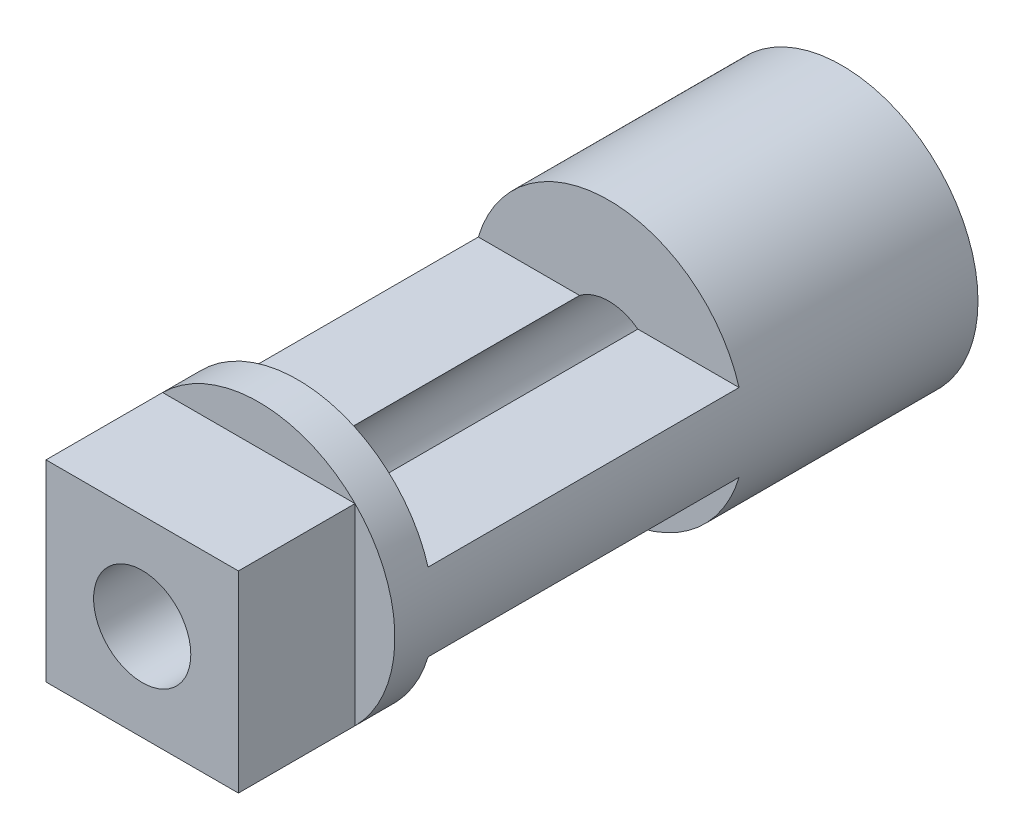
ISO-10303-21;
HEADER;
FILE_DESCRIPTION(('STEP AP214'),'2;1');
FILE_NAME('part.step','',(''),(''),'','','');
FILE_SCHEMA(('AUTOMOTIVE_DESIGN { 1 0 10303 214 1 1 1 1 }'));
ENDSEC;
DATA;
#1=APPLICATION_CONTEXT('core data for automotive mechanical design processes');
#2=APPLICATION_PROTOCOL_DEFINITION('international standard','automotive_design',2000,#1);
#3=PRODUCT_CONTEXT('',#1,'mechanical');
#4=PRODUCT('Part','Part','',(#3));
#5=PRODUCT_RELATED_PRODUCT_CATEGORY('part','',(#4));
#6=PRODUCT_DEFINITION_FORMATION('','',#4);
#7=PRODUCT_DEFINITION_CONTEXT('part definition',#1,'design');
#8=PRODUCT_DEFINITION('design','',#6,#7);
#9=PRODUCT_DEFINITION_SHAPE('','',#8);
#10=(LENGTH_UNIT() NAMED_UNIT(*) SI_UNIT(.MILLI.,.METRE.));
#11=(NAMED_UNIT(*) PLANE_ANGLE_UNIT() SI_UNIT($,.RADIAN.));
#12=(NAMED_UNIT(*) SI_UNIT($,.STERADIAN.) SOLID_ANGLE_UNIT());
#13=UNCERTAINTY_MEASURE_WITH_UNIT(LENGTH_MEASURE(1.E-05),#10,'distance_accuracy_value','');
#14=(GEOMETRIC_REPRESENTATION_CONTEXT(3) GLOBAL_UNCERTAINTY_ASSIGNED_CONTEXT((#13)) GLOBAL_UNIT_ASSIGNED_CONTEXT((#10,
#11,#12)) REPRESENTATION_CONTEXT('',''));
#15=CARTESIAN_POINT('',(0.,0.,0.));
#16=DIRECTION('',(0.,0.,1.));
#17=DIRECTION('',(1.,0.,0.));
#18=AXIS2_PLACEMENT_3D('',#15,#16,#17);
#19=CARTESIAN_POINT('',(0.,0.,23.));
#20=DIRECTION('',(0.,0.,-1.));
#21=DIRECTION('',(-1.,0.,0.));
#22=AXIS2_PLACEMENT_3D('',#19,#20,#21);
#23=CYLINDRICAL_SURFACE('',#22,3.5);
#24=CARTESIAN_POINT('',(0.,0.,11.));
#25=DIRECTION('',(0.,0.,1.));
#26=DIRECTION('',(1.,0.,0.));
#27=AXIS2_PLACEMENT_3D('',#24,#25,#26);
#28=CIRCLE('',#27,3.5);
#29=CARTESIAN_POINT('',(-3.35410196624968,-1.,11.));
#30=VERTEX_POINT('',#29);
#31=CARTESIAN_POINT('',(3.35410196624968,-1.,11.));
#32=VERTEX_POINT('',#31);
#33=EDGE_CURVE('E217',#30,#32,#28,.T.);
#34=ORIENTED_EDGE('',*,*,#33,.F.);
#35=DIRECTION('',(0.,0.,-1.));
#36=VECTOR('',#35,1.);
#37=CARTESIAN_POINT('',(-3.35410196624968,-1.,23.));
#38=LINE('',#37,#36);
#39=CARTESIAN_POINT('',(-3.35410196624968,-1.,19.));
#40=VERTEX_POINT('',#39);
#41=EDGE_CURVE('E213',#40,#30,#38,.T.);
#42=ORIENTED_EDGE('',*,*,#41,.F.);
#43=CARTESIAN_POINT('',(0.,0.,19.));
#44=DIRECTION('',(0.,0.,-1.));
#45=DIRECTION('',(-1.,0.,0.));
#46=AXIS2_PLACEMENT_3D('',#43,#44,#45);
#47=CIRCLE('',#46,3.5);
#48=CARTESIAN_POINT('',(3.35410196624968,-1.,19.));
#49=VERTEX_POINT('',#48);
#50=EDGE_CURVE('E208',#49,#40,#47,.T.);
#51=ORIENTED_EDGE('',*,*,#50,.F.);
#52=DIRECTION('',(0.,0.,-1.));
#53=VECTOR('',#52,1.);
#54=CARTESIAN_POINT('',(3.35410196624968,-1.,23.));
#55=LINE('',#54,#53);
#56=EDGE_CURVE('E215',#32,#49,#55,.F.);
#57=ORIENTED_EDGE('',*,*,#56,.F.);
#58=EDGE_LOOP('',(#34,#42,#51,#57));
#59=FACE_BOUND('',#58,.T.);
#60=CARTESIAN_POINT('',(0.,0.,5.));
#61=DIRECTION('',(0.,0.,1.));
#62=DIRECTION('',(1.,0.,0.));
#63=AXIS2_PLACEMENT_3D('',#60,#61,#62);
#64=CIRCLE('',#63,3.5);
#65=CARTESIAN_POINT('',(3.5,0.,5.));
#66=VERTEX_POINT('',#65);
#67=EDGE_CURVE('E185',#66,#66,#64,.T.);
#68=ORIENTED_EDGE('',*,*,#67,.T.);
#69=EDGE_LOOP('',(#68));
#70=FACE_BOUND('',#69,.T.);
#71=CARTESIAN_POINT('',(0.,0.,19.));
#72=DIRECTION('',(0.,0.,1.));
#73=DIRECTION('',(1.,0.,0.));
#74=AXIS2_PLACEMENT_3D('',#71,#72,#73);
#75=CIRCLE('',#74,3.5);
#76=CARTESIAN_POINT('',(3.35410196624968,1.,19.));
#77=VERTEX_POINT('',#76);
#78=CARTESIAN_POINT('',(-3.35410196624968,1.,19.));
#79=VERTEX_POINT('',#78);
#80=EDGE_CURVE('E192',#77,#79,#75,.T.);
#81=ORIENTED_EDGE('',*,*,#80,.T.);
#82=DIRECTION('',(0.,0.,-1.));
#83=VECTOR('',#82,1.);
#84=CARTESIAN_POINT('',(-3.35410196624968,1.,23.));
#85=LINE('',#84,#83);
#86=CARTESIAN_POINT('',(-3.35410196624968,1.,11.));
#87=VERTEX_POINT('',#86);
#88=EDGE_CURVE('E198',#79,#87,#85,.T.);
#89=ORIENTED_EDGE('',*,*,#88,.T.);
#90=CARTESIAN_POINT('',(0.,0.,11.));
#91=DIRECTION('',(0.,0.,-1.));
#92=DIRECTION('',(-1.,0.,0.));
#93=AXIS2_PLACEMENT_3D('',#90,#91,#92);
#94=CIRCLE('',#93,3.5);
#95=CARTESIAN_POINT('',(3.35410196624968,1.,11.));
#96=VERTEX_POINT('',#95);
#97=EDGE_CURVE('E196',#87,#96,#94,.T.);
#98=ORIENTED_EDGE('',*,*,#97,.T.);
#99=DIRECTION('',(0.,0.,-1.));
#100=VECTOR('',#99,1.);
#101=CARTESIAN_POINT('',(3.35410196624968,1.,23.));
#102=LINE('',#101,#100);
#103=EDGE_CURVE('E201',#96,#77,#102,.F.);
#104=ORIENTED_EDGE('',*,*,#103,.T.);
#105=EDGE_LOOP('',(#81,#89,#98,#104));
#106=FACE_BOUND('',#105,.T.);
#107=CARTESIAN_POINT('',(0.,0.,20.));
#108=DIRECTION('',(0.,0.,1.));
#109=DIRECTION('',(1.,0.,0.));
#110=AXIS2_PLACEMENT_3D('',#107,#108,#109);
#111=CIRCLE('',#110,3.5);
#112=CARTESIAN_POINT('',(2.47487373415292,2.47487373415292,20.));
#113=VERTEX_POINT('',#112);
#114=CARTESIAN_POINT('',(-2.47487373415292,2.47487373415292,20.));
#115=VERTEX_POINT('',#114);
#116=EDGE_CURVE('E12',#113,#115,#111,.T.);
#117=ORIENTED_EDGE('',*,*,#116,.F.);
#118=CARTESIAN_POINT('',(2.47487373415292,-2.47487373415292,20.));
#119=VERTEX_POINT('',#118);
#120=EDGE_CURVE('E47',#119,#113,#111,.T.);
#121=ORIENTED_EDGE('',*,*,#120,.F.);
#122=CARTESIAN_POINT('',(-2.47487373415292,-2.47487373415292,20.));
#123=VERTEX_POINT('',#122);
#124=EDGE_CURVE('E136',#123,#119,#111,.T.);
#125=ORIENTED_EDGE('',*,*,#124,.F.);
#126=EDGE_CURVE('E42',#115,#123,#111,.T.);
#127=ORIENTED_EDGE('',*,*,#126,.F.);
#128=EDGE_LOOP('',(#117,#121,#125,#127));
#129=FACE_BOUND('',#128,.T.);
#130=ADVANCED_FACE('F39',(#59,#70,#106,#129),#23,.T.);
#131=CARTESIAN_POINT('',(0.,0.,23.));
#132=DIRECTION('',(0.,0.,1.));
#133=DIRECTION('',(1.,0.,0.));
#134=AXIS2_PLACEMENT_3D('',#131,#132,#133);
#135=PLANE('',#134);
#136=CARTESIAN_POINT('',(0.,0.,23.));
#137=DIRECTION('',(0.,0.,1.));
#138=DIRECTION('',(1.,0.,0.));
#139=AXIS2_PLACEMENT_3D('',#136,#137,#138);
#140=CIRCLE('',#139,1.25);
#141=CARTESIAN_POINT('',(1.25,0.,23.));
#142=VERTEX_POINT('',#141);
#143=EDGE_CURVE('E188',#142,#142,#140,.T.);
#144=ORIENTED_EDGE('',*,*,#143,.F.);
#145=EDGE_LOOP('',(#144));
#146=FACE_BOUND('',#145,.T.);
#147=DIRECTION('',(1.,0.,0.));
#148=VECTOR('',#147,1.);
#149=CARTESIAN_POINT('',(-2.47487373415292,-2.47487373415292,23.));
#150=LINE('',#149,#148);
#151=CARTESIAN_POINT('',(-2.47487373415292,-2.47487373415292,23.));
#152=VERTEX_POINT('',#151);
#153=CARTESIAN_POINT('',(2.47487373415292,-2.47487373415292,23.));
#154=VERTEX_POINT('',#153);
#155=EDGE_CURVE('E160',#152,#154,#150,.T.);
#156=ORIENTED_EDGE('',*,*,#155,.T.);
#157=DIRECTION('',(0.,1.,0.));
#158=VECTOR('',#157,1.);
#159=CARTESIAN_POINT('',(2.47487373415292,-2.47487373415292,23.));
#160=LINE('',#159,#158);
#161=CARTESIAN_POINT('',(2.47487373415292,2.47487373415292,23.));
#162=VERTEX_POINT('',#161);
#163=EDGE_CURVE('E235',#154,#162,#160,.T.);
#164=ORIENTED_EDGE('',*,*,#163,.T.);
#165=DIRECTION('',(-1.,0.,0.));
#166=VECTOR('',#165,1.);
#167=CARTESIAN_POINT('',(-2.47487373415292,2.47487373415292,23.));
#168=LINE('',#167,#166);
#169=CARTESIAN_POINT('',(-2.47487373415292,2.47487373415292,23.));
#170=VERTEX_POINT('',#169);
#171=EDGE_CURVE('E146',#162,#170,#168,.T.);
#172=ORIENTED_EDGE('',*,*,#171,.T.);
#173=DIRECTION('',(0.,-1.,0.));
#174=VECTOR('',#173,1.);
#175=CARTESIAN_POINT('',(-2.47487373415292,-2.47487373415292,23.));
#176=LINE('',#175,#174);
#177=EDGE_CURVE('E62',#170,#152,#176,.T.);
#178=ORIENTED_EDGE('',*,*,#177,.T.);
#179=EDGE_LOOP('',(#156,#164,#172,#178));
#180=FACE_BOUND('',#179,.T.);
#181=ADVANCED_FACE('F254',(#146,#180),#135,.T.);
#182=CARTESIAN_POINT('',(0.,0.,23.));
#183=DIRECTION('',(0.,0.,-1.));
#184=DIRECTION('',(-1.,0.,0.));
#185=AXIS2_PLACEMENT_3D('',#182,#183,#184);
#186=CYLINDRICAL_SURFACE('',#185,1.25);
#187=DIRECTION('',(0.,0.,-1.));
#188=VECTOR('',#187,1.);
#189=CARTESIAN_POINT('',(-0.749999999999999,1.,23.));
#190=LINE('',#189,#188);
#191=CARTESIAN_POINT('',(-0.749999999999999,1.,19.));
#192=VERTEX_POINT('',#191);
#193=CARTESIAN_POINT('',(-0.749999999999999,1.,11.));
#194=VERTEX_POINT('',#193);
#195=EDGE_CURVE('E176',#192,#194,#190,.T.);
#196=ORIENTED_EDGE('',*,*,#195,.F.);
#197=CARTESIAN_POINT('',(0.,0.,19.));
#198=DIRECTION('',(0.,0.,1.));
#199=DIRECTION('',(1.,0.,0.));
#200=AXIS2_PLACEMENT_3D('',#197,#198,#199);
#201=CIRCLE('',#200,1.25);
#202=CARTESIAN_POINT('',(0.749999999999998,1.,19.));
#203=VERTEX_POINT('',#202);
#204=EDGE_CURVE('E178',#203,#192,#201,.T.);
#205=ORIENTED_EDGE('',*,*,#204,.F.);
#206=DIRECTION('',(0.,0.,-1.));
#207=VECTOR('',#206,1.);
#208=CARTESIAN_POINT('',(0.749999999999999,1.,23.));
#209=LINE('',#208,#207);
#210=CARTESIAN_POINT('',(0.749999999999999,1.,11.));
#211=VERTEX_POINT('',#210);
#212=EDGE_CURVE('E183',#211,#203,#209,.F.);
#213=ORIENTED_EDGE('',*,*,#212,.F.);
#214=CARTESIAN_POINT('',(0.,0.,11.));
#215=DIRECTION('',(0.,0.,-1.));
#216=DIRECTION('',(-1.,0.,0.));
#217=AXIS2_PLACEMENT_3D('',#214,#215,#216);
#218=CIRCLE('',#217,1.25);
#219=EDGE_CURVE('E180',#194,#211,#218,.T.);
#220=ORIENTED_EDGE('',*,*,#219,.F.);
#221=EDGE_LOOP('',(#196,#205,#213,#220));
#222=FACE_BOUND('',#221,.T.);
#223=ORIENTED_EDGE('',*,*,#143,.T.);
#224=EDGE_LOOP('',(#223));
#225=FACE_BOUND('',#224,.T.);
#226=CARTESIAN_POINT('',(0.,0.,5.));
#227=DIRECTION('',(0.,0.,1.));
#228=DIRECTION('',(1.,0.,0.));
#229=AXIS2_PLACEMENT_3D('',#226,#227,#228);
#230=CIRCLE('',#229,1.25);
#231=CARTESIAN_POINT('',(1.25,0.,5.));
#232=VERTEX_POINT('',#231);
#233=EDGE_CURVE('E189',#232,#232,#230,.T.);
#234=ORIENTED_EDGE('',*,*,#233,.F.);
#235=EDGE_LOOP('',(#234));
#236=FACE_BOUND('',#235,.T.);
#237=DIRECTION('',(0.,0.,-1.));
#238=VECTOR('',#237,1.);
#239=CARTESIAN_POINT('',(0.749999999999999,-1.,23.));
#240=LINE('',#239,#238);
#241=CARTESIAN_POINT('',(0.749999999999999,-1.,11.));
#242=VERTEX_POINT('',#241);
#243=CARTESIAN_POINT('',(0.749999999999998,-1.,19.));
#244=VERTEX_POINT('',#243);
#245=EDGE_CURVE('E169',#242,#244,#240,.F.);
#246=ORIENTED_EDGE('',*,*,#245,.T.);
#247=CARTESIAN_POINT('',(0.,0.,19.));
#248=DIRECTION('',(0.,0.,-1.));
#249=DIRECTION('',(-1.,0.,0.));
#250=AXIS2_PLACEMENT_3D('',#247,#248,#249);
#251=CIRCLE('',#250,1.25);
#252=CARTESIAN_POINT('',(-0.749999999999999,-1.,19.));
#253=VERTEX_POINT('',#252);
#254=EDGE_CURVE('E163',#244,#253,#251,.T.);
#255=ORIENTED_EDGE('',*,*,#254,.T.);
#256=DIRECTION('',(0.,0.,-1.));
#257=VECTOR('',#256,1.);
#258=CARTESIAN_POINT('',(-0.749999999999999,-1.,23.));
#259=LINE('',#258,#257);
#260=CARTESIAN_POINT('',(-0.749999999999999,-1.,11.));
#261=VERTEX_POINT('',#260);
#262=EDGE_CURVE('E165',#253,#261,#259,.T.);
#263=ORIENTED_EDGE('',*,*,#262,.T.);
#264=CARTESIAN_POINT('',(0.,0.,11.));
#265=DIRECTION('',(0.,0.,1.));
#266=DIRECTION('',(1.,0.,0.));
#267=AXIS2_PLACEMENT_3D('',#264,#265,#266);
#268=CIRCLE('',#267,1.25);
#269=EDGE_CURVE('E173',#261,#242,#268,.T.);
#270=ORIENTED_EDGE('',*,*,#269,.T.);
#271=EDGE_LOOP('',(#246,#255,#263,#270));
#272=FACE_BOUND('',#271,.T.);
#273=ADVANCED_FACE('F259',(#222,#225,#236,#272),#186,.F.);
#274=CARTESIAN_POINT('',(0.,0.,5.));
#275=DIRECTION('',(0.,0.,1.));
#276=DIRECTION('',(1.,0.,0.));
#277=AXIS2_PLACEMENT_3D('',#274,#275,#276);
#278=PLANE('',#277);
#279=ORIENTED_EDGE('',*,*,#67,.F.);
#280=EDGE_LOOP('',(#279));
#281=FACE_BOUND('',#280,.T.);
#282=ORIENTED_EDGE('',*,*,#233,.T.);
#283=EDGE_LOOP('',(#282));
#284=FACE_BOUND('',#283,.T.);
#285=ADVANCED_FACE('F304',(#281,#284),#278,.F.);
#286=CARTESIAN_POINT('',(-3.5,3.5,19.));
#287=DIRECTION('',(0.,0.,1.));
#288=DIRECTION('',(1.,0.,0.));
#289=AXIS2_PLACEMENT_3D('',#286,#287,#288);
#290=PLANE('',#289);
#291=DIRECTION('',(1.,0.,0.));
#292=VECTOR('',#291,1.);
#293=CARTESIAN_POINT('',(-3.5,1.,19.));
#294=LINE('',#293,#292);
#295=EDGE_CURVE('E205',#203,#77,#294,.T.);
#296=ORIENTED_EDGE('',*,*,#295,.F.);
#297=ORIENTED_EDGE('',*,*,#204,.T.);
#298=EDGE_CURVE('E207',#79,#192,#294,.T.);
#299=ORIENTED_EDGE('',*,*,#298,.F.);
#300=ORIENTED_EDGE('',*,*,#80,.F.);
#301=EDGE_LOOP('',(#296,#297,#299,#300));
#302=FACE_BOUND('',#301,.T.);
#303=ADVANCED_FACE('F280',(#302),#290,.F.);
#304=CARTESIAN_POINT('',(-3.5,3.5,11.));
#305=DIRECTION('',(0.,0.,-1.));
#306=DIRECTION('',(-1.,0.,0.));
#307=AXIS2_PLACEMENT_3D('',#304,#305,#306);
#308=PLANE('',#307);
#309=DIRECTION('',(1.,0.,0.));
#310=VECTOR('',#309,1.);
#311=CARTESIAN_POINT('',(-3.5,1.,11.));
#312=LINE('',#311,#310);
#313=EDGE_CURVE('E204',#87,#194,#312,.T.);
#314=ORIENTED_EDGE('',*,*,#313,.T.);
#315=ORIENTED_EDGE('',*,*,#219,.T.);
#316=EDGE_CURVE('E209',#211,#96,#312,.T.);
#317=ORIENTED_EDGE('',*,*,#316,.T.);
#318=ORIENTED_EDGE('',*,*,#97,.F.);
#319=EDGE_LOOP('',(#314,#315,#317,#318));
#320=FACE_BOUND('',#319,.T.);
#321=ADVANCED_FACE('F287',(#320),#308,.F.);
#322=CARTESIAN_POINT('',(-3.5,1.,19.));
#323=DIRECTION('',(0.,-1.,0.));
#324=DIRECTION('',(0.,0.,-1.));
#325=AXIS2_PLACEMENT_3D('',#322,#323,#324);
#326=PLANE('',#325);
#327=ORIENTED_EDGE('',*,*,#298,.T.);
#328=ORIENTED_EDGE('',*,*,#195,.T.);
#329=ORIENTED_EDGE('',*,*,#313,.F.);
#330=ORIENTED_EDGE('',*,*,#88,.F.);
#331=EDGE_LOOP('',(#327,#328,#329,#330));
#332=FACE_BOUND('',#331,.T.);
#333=ADVANCED_FACE('F277',(#332),#326,.F.);
#334=ORIENTED_EDGE('',*,*,#316,.F.);
#335=ORIENTED_EDGE('',*,*,#212,.T.);
#336=ORIENTED_EDGE('',*,*,#295,.T.);
#337=ORIENTED_EDGE('',*,*,#103,.F.);
#338=EDGE_LOOP('',(#334,#335,#336,#337));
#339=FACE_BOUND('',#338,.T.);
#340=ADVANCED_FACE('F289',(#339),#326,.F.);
#341=CARTESIAN_POINT('',(-3.5,-3.5,19.));
#342=DIRECTION('',(0.,0.,-1.));
#343=DIRECTION('',(-1.,0.,0.));
#344=AXIS2_PLACEMENT_3D('',#341,#342,#343);
#345=PLANE('',#344);
#346=ORIENTED_EDGE('',*,*,#50,.T.);
#347=DIRECTION('',(1.,0.,0.));
#348=VECTOR('',#347,1.);
#349=CARTESIAN_POINT('',(-3.5,-1.,19.));
#350=LINE('',#349,#348);
#351=EDGE_CURVE('E219',#40,#253,#350,.T.);
#352=ORIENTED_EDGE('',*,*,#351,.T.);
#353=ORIENTED_EDGE('',*,*,#254,.F.);
#354=EDGE_CURVE('E224',#244,#49,#350,.T.);
#355=ORIENTED_EDGE('',*,*,#354,.T.);
#356=EDGE_LOOP('',(#346,#352,#353,#355));
#357=FACE_BOUND('',#356,.T.);
#358=ADVANCED_FACE('F291',(#357),#345,.T.);
#359=CARTESIAN_POINT('',(-3.5,-1.,19.));
#360=DIRECTION('',(0.,-1.,0.));
#361=DIRECTION('',(0.,0.,-1.));
#362=AXIS2_PLACEMENT_3D('',#359,#360,#361);
#363=PLANE('',#362);
#364=ORIENTED_EDGE('',*,*,#41,.T.);
#365=DIRECTION('',(1.,0.,0.));
#366=VECTOR('',#365,1.);
#367=CARTESIAN_POINT('',(-3.5,-1.,11.));
#368=LINE('',#367,#366);
#369=EDGE_CURVE('E223',#30,#261,#368,.T.);
#370=ORIENTED_EDGE('',*,*,#369,.T.);
#371=ORIENTED_EDGE('',*,*,#262,.F.);
#372=ORIENTED_EDGE('',*,*,#351,.F.);
#373=EDGE_LOOP('',(#364,#370,#371,#372));
#374=FACE_BOUND('',#373,.T.);
#375=ADVANCED_FACE('F297',(#374),#363,.T.);
#376=ORIENTED_EDGE('',*,*,#56,.T.);
#377=ORIENTED_EDGE('',*,*,#354,.F.);
#378=ORIENTED_EDGE('',*,*,#245,.F.);
#379=EDGE_CURVE('E220',#242,#32,#368,.T.);
#380=ORIENTED_EDGE('',*,*,#379,.T.);
#381=EDGE_LOOP('',(#376,#377,#378,#380));
#382=FACE_BOUND('',#381,.T.);
#383=ADVANCED_FACE('F316',(#382),#363,.T.);
#384=CARTESIAN_POINT('',(-3.5,-3.5,11.));
#385=DIRECTION('',(0.,0.,1.));
#386=DIRECTION('',(1.,0.,0.));
#387=AXIS2_PLACEMENT_3D('',#384,#385,#386);
#388=PLANE('',#387);
#389=ORIENTED_EDGE('',*,*,#33,.T.);
#390=ORIENTED_EDGE('',*,*,#379,.F.);
#391=ORIENTED_EDGE('',*,*,#269,.F.);
#392=ORIENTED_EDGE('',*,*,#369,.F.);
#393=EDGE_LOOP('',(#389,#390,#391,#392));
#394=FACE_BOUND('',#393,.T.);
#395=ADVANCED_FACE('F250',(#394),#388,.T.);
#396=CARTESIAN_POINT('',(0.,0.,20.));
#397=DIRECTION('',(0.,0.,1.));
#398=DIRECTION('',(1.,0.,0.));
#399=AXIS2_PLACEMENT_3D('',#396,#397,#398);
#400=PLANE('',#399);
#401=ORIENTED_EDGE('',*,*,#116,.T.);
#402=DIRECTION('',(-1.,0.,0.));
#403=VECTOR('',#402,1.);
#404=CARTESIAN_POINT('',(-2.47487373415292,2.47487373415292,20.));
#405=LINE('',#404,#403);
#406=EDGE_CURVE('E143',#113,#115,#405,.T.);
#407=ORIENTED_EDGE('',*,*,#406,.F.);
#408=EDGE_LOOP('',(#401,#407));
#409=FACE_BOUND('',#408,.T.);
#410=ADVANCED_FACE('F153',(#409),#400,.T.);
#411=ORIENTED_EDGE('',*,*,#126,.T.);
#412=DIRECTION('',(0.,-1.,0.));
#413=VECTOR('',#412,1.);
#414=CARTESIAN_POINT('',(-2.47487373415292,-2.47487373415292,20.));
#415=LINE('',#414,#413);
#416=EDGE_CURVE('E155',#115,#123,#415,.T.);
#417=ORIENTED_EDGE('',*,*,#416,.F.);
#418=EDGE_LOOP('',(#411,#417));
#419=FACE_BOUND('',#418,.T.);
#420=ADVANCED_FACE('F241',(#419),#400,.T.);
#421=ORIENTED_EDGE('',*,*,#124,.T.);
#422=DIRECTION('',(1.,0.,0.));
#423=VECTOR('',#422,1.);
#424=CARTESIAN_POINT('',(-2.47487373415292,-2.47487373415292,20.));
#425=LINE('',#424,#423);
#426=EDGE_CURVE('E54',#123,#119,#425,.T.);
#427=ORIENTED_EDGE('',*,*,#426,.F.);
#428=EDGE_LOOP('',(#421,#427));
#429=FACE_BOUND('',#428,.T.);
#430=ADVANCED_FACE('F243',(#429),#400,.T.);
#431=ORIENTED_EDGE('',*,*,#120,.T.);
#432=DIRECTION('',(0.,1.,0.));
#433=VECTOR('',#432,1.);
#434=CARTESIAN_POINT('',(2.47487373415292,-2.47487373415292,20.));
#435=LINE('',#434,#433);
#436=EDGE_CURVE('E131',#119,#113,#435,.T.);
#437=ORIENTED_EDGE('',*,*,#436,.F.);
#438=EDGE_LOOP('',(#431,#437));
#439=FACE_BOUND('',#438,.T.);
#440=ADVANCED_FACE('F129',(#439),#400,.T.);
#441=CARTESIAN_POINT('',(2.47487373415292,-2.47487373415292,20.));
#442=DIRECTION('',(1.,0.,0.));
#443=DIRECTION('',(0.,0.,-1.));
#444=AXIS2_PLACEMENT_3D('',#441,#442,#443);
#445=PLANE('',#444);
#446=ORIENTED_EDGE('',*,*,#163,.F.);
#447=DIRECTION('',(0.,0.,1.));
#448=VECTOR('',#447,1.);
#449=CARTESIAN_POINT('',(2.47487373415292,-2.47487373415292,20.));
#450=LINE('',#449,#448);
#451=EDGE_CURVE('E158',#119,#154,#450,.T.);
#452=ORIENTED_EDGE('',*,*,#451,.F.);
#453=ORIENTED_EDGE('',*,*,#436,.T.);
#454=DIRECTION('',(0.,0.,1.));
#455=VECTOR('',#454,1.);
#456=CARTESIAN_POINT('',(2.47487373415292,2.47487373415292,20.));
#457=LINE('',#456,#455);
#458=EDGE_CURVE('E140',#113,#162,#457,.T.);
#459=ORIENTED_EDGE('',*,*,#458,.T.);
#460=EDGE_LOOP('',(#446,#452,#453,#459));
#461=FACE_BOUND('',#460,.T.);
#462=ADVANCED_FACE('F157',(#461),#445,.T.);
#463=CARTESIAN_POINT('',(-2.47487373415292,-2.47487373415292,20.));
#464=DIRECTION('',(0.,-1.,0.));
#465=DIRECTION('',(0.,0.,-1.));
#466=AXIS2_PLACEMENT_3D('',#463,#464,#465);
#467=PLANE('',#466);
#468=ORIENTED_EDGE('',*,*,#155,.F.);
#469=DIRECTION('',(0.,0.,1.));
#470=VECTOR('',#469,1.);
#471=CARTESIAN_POINT('',(-2.47487373415292,-2.47487373415292,20.));
#472=LINE('',#471,#470);
#473=EDGE_CURVE('E228',#123,#152,#472,.T.);
#474=ORIENTED_EDGE('',*,*,#473,.F.);
#475=ORIENTED_EDGE('',*,*,#426,.T.);
#476=ORIENTED_EDGE('',*,*,#451,.T.);
#477=EDGE_LOOP('',(#468,#474,#475,#476));
#478=FACE_BOUND('',#477,.T.);
#479=ADVANCED_FACE('F384',(#478),#467,.T.);
#480=CARTESIAN_POINT('',(-2.47487373415292,-2.47487373415292,20.));
#481=DIRECTION('',(-1.,0.,0.));
#482=DIRECTION('',(0.,0.,1.));
#483=AXIS2_PLACEMENT_3D('',#480,#481,#482);
#484=PLANE('',#483);
#485=ORIENTED_EDGE('',*,*,#177,.F.);
#486=DIRECTION('',(0.,0.,1.));
#487=VECTOR('',#486,1.);
#488=CARTESIAN_POINT('',(-2.47487373415292,2.47487373415292,20.));
#489=LINE('',#488,#487);
#490=EDGE_CURVE('E150',#115,#170,#489,.T.);
#491=ORIENTED_EDGE('',*,*,#490,.F.);
#492=ORIENTED_EDGE('',*,*,#416,.T.);
#493=ORIENTED_EDGE('',*,*,#473,.T.);
#494=EDGE_LOOP('',(#485,#491,#492,#493));
#495=FACE_BOUND('',#494,.T.);
#496=ADVANCED_FACE('F239',(#495),#484,.T.);
#497=CARTESIAN_POINT('',(-2.47487373415292,2.47487373415292,20.));
#498=DIRECTION('',(0.,1.,0.));
#499=DIRECTION('',(0.,0.,1.));
#500=AXIS2_PLACEMENT_3D('',#497,#498,#499);
#501=PLANE('',#500);
#502=ORIENTED_EDGE('',*,*,#171,.F.);
#503=ORIENTED_EDGE('',*,*,#458,.F.);
#504=ORIENTED_EDGE('',*,*,#406,.T.);
#505=ORIENTED_EDGE('',*,*,#490,.T.);
#506=EDGE_LOOP('',(#502,#503,#504,#505));
#507=FACE_BOUND('',#506,.T.);
#508=ADVANCED_FACE('F142',(#507),#501,.T.);
#509=CLOSED_SHELL('',(#130,#181,#273,#285,#303,#321,#333,#340,#358,#375,#383,#395,#410,#420,
#430,#440,#462,#479,#496,#508));
#510=MANIFOLD_SOLID_BREP('B2',#509);
#511=ADVANCED_BREP_SHAPE_REPRESENTATION('',(#18,#510),#14);
#512=SHAPE_DEFINITION_REPRESENTATION(#9,#511);
ENDSEC;
END-ISO-10303-21;
